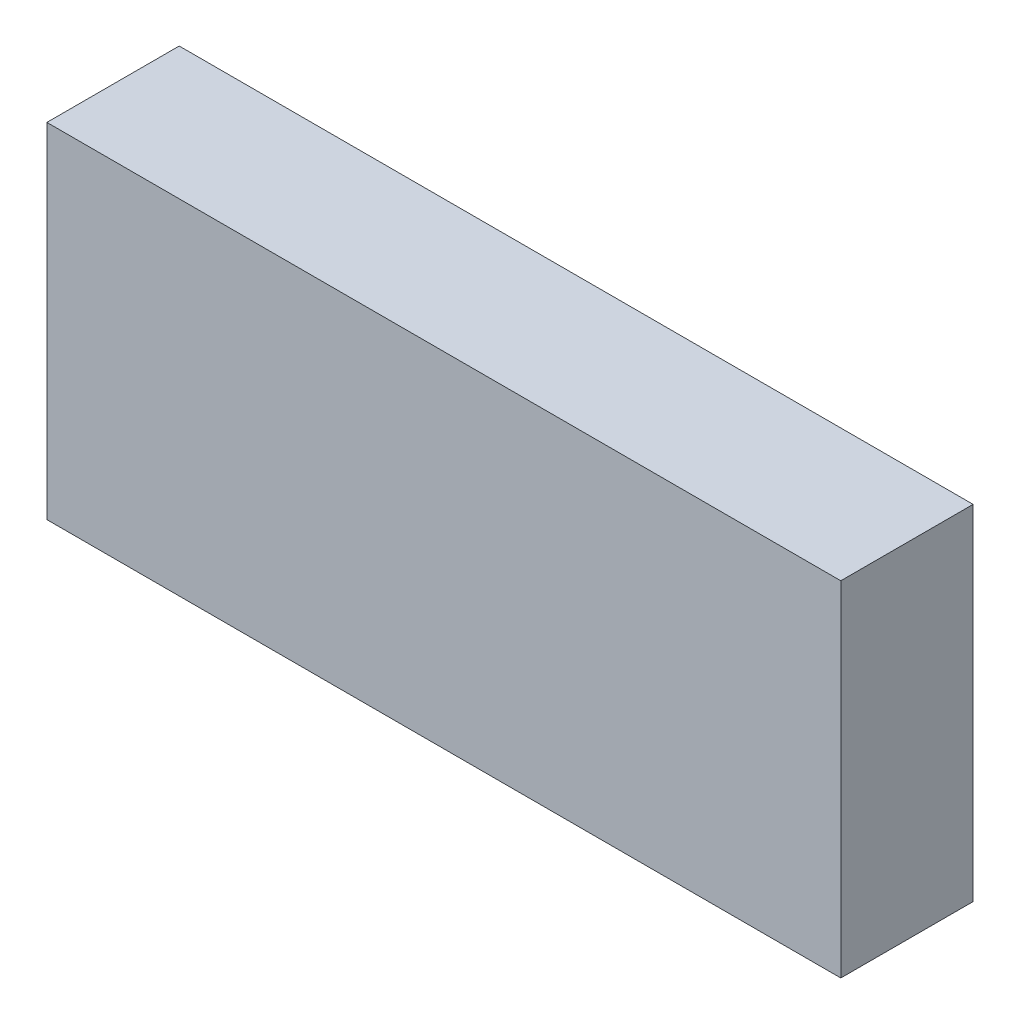
ISO-10303-21;
HEADER;
FILE_DESCRIPTION(('STEP AP214'),'2;1');
FILE_NAME('part.step','',(''),(''),'','','');
FILE_SCHEMA(('AUTOMOTIVE_DESIGN { 1 0 10303 214 1 1 1 1 }'));
ENDSEC;
DATA;
#1=APPLICATION_CONTEXT('core data for automotive mechanical design processes');
#2=APPLICATION_PROTOCOL_DEFINITION('international standard','automotive_design',2000,#1);
#3=PRODUCT_CONTEXT('',#1,'mechanical');
#4=PRODUCT('Part','Part','',(#3));
#5=PRODUCT_RELATED_PRODUCT_CATEGORY('part','',(#4));
#6=PRODUCT_DEFINITION_FORMATION('','',#4);
#7=PRODUCT_DEFINITION_CONTEXT('part definition',#1,'design');
#8=PRODUCT_DEFINITION('design','',#6,#7);
#9=PRODUCT_DEFINITION_SHAPE('','',#8);
#10=(LENGTH_UNIT() NAMED_UNIT(*) SI_UNIT(.MILLI.,.METRE.));
#11=(NAMED_UNIT(*) PLANE_ANGLE_UNIT() SI_UNIT($,.RADIAN.));
#12=(NAMED_UNIT(*) SI_UNIT($,.STERADIAN.) SOLID_ANGLE_UNIT());
#13=UNCERTAINTY_MEASURE_WITH_UNIT(LENGTH_MEASURE(1.E-05),#10,'distance_accuracy_value','');
#14=(GEOMETRIC_REPRESENTATION_CONTEXT(3) GLOBAL_UNCERTAINTY_ASSIGNED_CONTEXT((#13)) GLOBAL_UNIT_ASSIGNED_CONTEXT((#10,
#11,#12)) REPRESENTATION_CONTEXT('',''));
#15=CARTESIAN_POINT('',(0.,0.,0.));
#16=DIRECTION('',(0.,0.,1.));
#17=DIRECTION('',(1.,0.,0.));
#18=AXIS2_PLACEMENT_3D('',#15,#16,#17);
#19=CARTESIAN_POINT('',(19.05,-8.255,3.175));
#20=DIRECTION('',(-1.,0.,0.));
#21=DIRECTION('',(0.,0.,1.));
#22=AXIS2_PLACEMENT_3D('',#19,#20,#21);
#23=PLANE('',#22);
#24=DIRECTION('',(0.,1.,0.));
#25=VECTOR('',#24,1.);
#26=CARTESIAN_POINT('',(19.05,-8.255,-3.175));
#27=LINE('',#26,#25);
#28=CARTESIAN_POINT('',(19.05,-8.255,-3.175));
#29=VERTEX_POINT('',#28);
#30=CARTESIAN_POINT('',(19.05,8.255,-3.175));
#31=VERTEX_POINT('',#30);
#32=EDGE_CURVE('E94',#29,#31,#27,.T.);
#33=ORIENTED_EDGE('',*,*,#32,.T.);
#34=DIRECTION('',(0.,0.,-1.));
#35=VECTOR('',#34,1.);
#36=CARTESIAN_POINT('',(19.05,8.255,3.175));
#37=LINE('',#36,#35);
#38=CARTESIAN_POINT('',(19.05,8.255,3.175));
#39=VERTEX_POINT('',#38);
#40=EDGE_CURVE('E11',#39,#31,#37,.T.);
#41=ORIENTED_EDGE('',*,*,#40,.F.);
#42=DIRECTION('',(0.,1.,0.));
#43=VECTOR('',#42,1.);
#44=CARTESIAN_POINT('',(19.05,-8.255,3.175));
#45=LINE('',#44,#43);
#46=CARTESIAN_POINT('',(19.05,-8.255,3.175));
#47=VERTEX_POINT('',#46);
#48=EDGE_CURVE('E82',#47,#39,#45,.T.);
#49=ORIENTED_EDGE('',*,*,#48,.F.);
#50=DIRECTION('',(0.,0.,-1.));
#51=VECTOR('',#50,1.);
#52=CARTESIAN_POINT('',(19.05,-8.255,3.175));
#53=LINE('',#52,#51);
#54=EDGE_CURVE('E90',#47,#29,#53,.T.);
#55=ORIENTED_EDGE('',*,*,#54,.T.);
#56=EDGE_LOOP('',(#33,#41,#49,#55));
#57=FACE_BOUND('',#56,.T.);
#58=ADVANCED_FACE('F31',(#57),#23,.F.);
#59=CARTESIAN_POINT('',(-19.05,8.255,3.175));
#60=DIRECTION('',(0.,-1.,0.));
#61=DIRECTION('',(0.,0.,-1.));
#62=AXIS2_PLACEMENT_3D('',#59,#60,#61);
#63=PLANE('',#62);
#64=DIRECTION('',(-1.,0.,0.));
#65=VECTOR('',#64,1.);
#66=CARTESIAN_POINT('',(-19.05,8.255,-3.175));
#67=LINE('',#66,#65);
#68=CARTESIAN_POINT('',(-19.05,8.255,-3.175));
#69=VERTEX_POINT('',#68);
#70=EDGE_CURVE('E86',#31,#69,#67,.T.);
#71=ORIENTED_EDGE('',*,*,#70,.T.);
#72=DIRECTION('',(0.,0.,-1.));
#73=VECTOR('',#72,1.);
#74=CARTESIAN_POINT('',(-19.05,8.255,3.175));
#75=LINE('',#74,#73);
#76=CARTESIAN_POINT('',(-19.05,8.255,3.175));
#77=VERTEX_POINT('',#76);
#78=EDGE_CURVE('E39',#77,#69,#75,.T.);
#79=ORIENTED_EDGE('',*,*,#78,.F.);
#80=DIRECTION('',(-1.,0.,0.));
#81=VECTOR('',#80,1.);
#82=CARTESIAN_POINT('',(-19.05,8.255,3.175));
#83=LINE('',#82,#81);
#84=EDGE_CURVE('E77',#39,#77,#83,.T.);
#85=ORIENTED_EDGE('',*,*,#84,.F.);
#86=ORIENTED_EDGE('',*,*,#40,.T.);
#87=EDGE_LOOP('',(#71,#79,#85,#86));
#88=FACE_BOUND('',#87,.T.);
#89=ADVANCED_FACE('F85',(#88),#63,.F.);
#90=CARTESIAN_POINT('',(-19.05,-8.255,3.175));
#91=DIRECTION('',(1.,0.,0.));
#92=DIRECTION('',(0.,0.,-1.));
#93=AXIS2_PLACEMENT_3D('',#90,#91,#92);
#94=PLANE('',#93);
#95=DIRECTION('',(0.,-1.,0.));
#96=VECTOR('',#95,1.);
#97=CARTESIAN_POINT('',(-19.05,-8.255,-3.175));
#98=LINE('',#97,#96);
#99=CARTESIAN_POINT('',(-19.05,-8.255,-3.175));
#100=VERTEX_POINT('',#99);
#101=EDGE_CURVE('E64',#69,#100,#98,.T.);
#102=ORIENTED_EDGE('',*,*,#101,.T.);
#103=DIRECTION('',(0.,0.,-1.));
#104=VECTOR('',#103,1.);
#105=CARTESIAN_POINT('',(-19.05,-8.255,3.175));
#106=LINE('',#105,#104);
#107=CARTESIAN_POINT('',(-19.05,-8.255,3.175));
#108=VERTEX_POINT('',#107);
#109=EDGE_CURVE('E87',#108,#100,#106,.T.);
#110=ORIENTED_EDGE('',*,*,#109,.F.);
#111=DIRECTION('',(0.,-1.,0.));
#112=VECTOR('',#111,1.);
#113=CARTESIAN_POINT('',(-19.05,-8.255,3.175));
#114=LINE('',#113,#112);
#115=EDGE_CURVE('E80',#77,#108,#114,.T.);
#116=ORIENTED_EDGE('',*,*,#115,.F.);
#117=ORIENTED_EDGE('',*,*,#78,.T.);
#118=EDGE_LOOP('',(#102,#110,#116,#117));
#119=FACE_BOUND('',#118,.T.);
#120=ADVANCED_FACE('F88',(#119),#94,.F.);
#121=CARTESIAN_POINT('',(-19.05,-8.255,3.175));
#122=DIRECTION('',(0.,1.,0.));
#123=DIRECTION('',(0.,0.,1.));
#124=AXIS2_PLACEMENT_3D('',#121,#122,#123);
#125=PLANE('',#124);
#126=DIRECTION('',(1.,0.,0.));
#127=VECTOR('',#126,1.);
#128=CARTESIAN_POINT('',(-19.05,-8.255,-3.175));
#129=LINE('',#128,#127);
#130=EDGE_CURVE('E70',#100,#29,#129,.T.);
#131=ORIENTED_EDGE('',*,*,#130,.T.);
#132=ORIENTED_EDGE('',*,*,#54,.F.);
#133=DIRECTION('',(1.,0.,0.));
#134=VECTOR('',#133,1.);
#135=CARTESIAN_POINT('',(-19.05,-8.255,3.175));
#136=LINE('',#135,#134);
#137=EDGE_CURVE('E47',#108,#47,#136,.T.);
#138=ORIENTED_EDGE('',*,*,#137,.F.);
#139=ORIENTED_EDGE('',*,*,#109,.T.);
#140=EDGE_LOOP('',(#131,#132,#138,#139));
#141=FACE_BOUND('',#140,.T.);
#142=ADVANCED_FACE('F101',(#141),#125,.F.);
#143=CARTESIAN_POINT('',(19.05,8.255,3.175));
#144=DIRECTION('',(0.,0.,-1.));
#145=DIRECTION('',(-1.,0.,0.));
#146=AXIS2_PLACEMENT_3D('',#143,#144,#145);
#147=PLANE('',#146);
#148=ORIENTED_EDGE('',*,*,#48,.T.);
#149=ORIENTED_EDGE('',*,*,#84,.T.);
#150=ORIENTED_EDGE('',*,*,#115,.T.);
#151=ORIENTED_EDGE('',*,*,#137,.T.);
#152=EDGE_LOOP('',(#148,#149,#150,#151));
#153=FACE_BOUND('',#152,.T.);
#154=ADVANCED_FACE('F78',(#153),#147,.F.);
#155=CARTESIAN_POINT('',(19.05,8.255,-3.175));
#156=DIRECTION('',(0.,0.,-1.));
#157=DIRECTION('',(-1.,0.,0.));
#158=AXIS2_PLACEMENT_3D('',#155,#156,#157);
#159=PLANE('',#158);
#160=ORIENTED_EDGE('',*,*,#32,.F.);
#161=ORIENTED_EDGE('',*,*,#130,.F.);
#162=ORIENTED_EDGE('',*,*,#101,.F.);
#163=ORIENTED_EDGE('',*,*,#70,.F.);
#164=EDGE_LOOP('',(#160,#161,#162,#163));
#165=FACE_BOUND('',#164,.T.);
#166=ADVANCED_FACE('F104',(#165),#159,.T.);
#167=CLOSED_SHELL('',(#58,#89,#120,#142,#154,#166));
#168=MANIFOLD_SOLID_BREP('B2',#167);
#169=ADVANCED_BREP_SHAPE_REPRESENTATION('',(#18,#168),#14);
#170=SHAPE_DEFINITION_REPRESENTATION(#9,#169);
ENDSEC;
END-ISO-10303-21;
